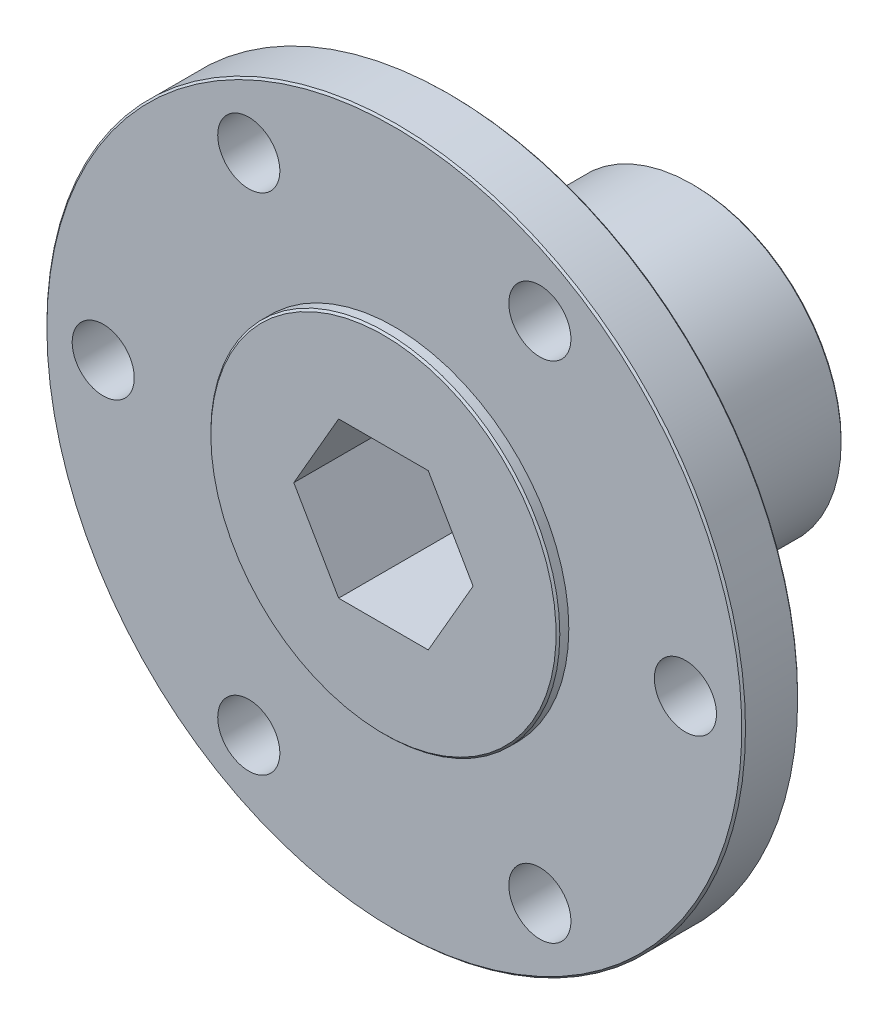
ISO-10303-21;
HEADER;
FILE_DESCRIPTION(('STEP AP214'),'2;1');
FILE_NAME('part.step','',(''),(''),'','','');
FILE_SCHEMA(('AUTOMOTIVE_DESIGN { 1 0 10303 214 1 1 1 1 }'));
ENDSEC;
DATA;
#1=APPLICATION_CONTEXT('core data for automotive mechanical design processes');
#2=APPLICATION_PROTOCOL_DEFINITION('international standard','automotive_design',2000,#1);
#3=PRODUCT_CONTEXT('',#1,'mechanical');
#4=PRODUCT('Part','Part','',(#3));
#5=PRODUCT_RELATED_PRODUCT_CATEGORY('part','',(#4));
#6=PRODUCT_DEFINITION_FORMATION('','',#4);
#7=PRODUCT_DEFINITION_CONTEXT('part definition',#1,'design');
#8=PRODUCT_DEFINITION('design','',#6,#7);
#9=PRODUCT_DEFINITION_SHAPE('','',#8);
#10=(LENGTH_UNIT() NAMED_UNIT(*) SI_UNIT(.MILLI.,.METRE.));
#11=(NAMED_UNIT(*) PLANE_ANGLE_UNIT() SI_UNIT($,.RADIAN.));
#12=(NAMED_UNIT(*) SI_UNIT($,.STERADIAN.) SOLID_ANGLE_UNIT());
#13=UNCERTAINTY_MEASURE_WITH_UNIT(LENGTH_MEASURE(1.E-05),#10,'distance_accuracy_value','');
#14=(GEOMETRIC_REPRESENTATION_CONTEXT(3) GLOBAL_UNCERTAINTY_ASSIGNED_CONTEXT((#13)) GLOBAL_UNIT_ASSIGNED_CONTEXT((#10,
#11,#12)) REPRESENTATION_CONTEXT('',''));
#15=CARTESIAN_POINT('',(0.,0.,0.));
#16=DIRECTION('',(0.,0.,1.));
#17=DIRECTION('',(1.,0.,0.));
#18=AXIS2_PLACEMENT_3D('',#15,#16,#17);
#19=CARTESIAN_POINT('',(-39.6748,0.,5.461));
#20=DIRECTION('',(0.,0.,1.));
#21=DIRECTION('',(1.,0.,0.));
#22=AXIS2_PLACEMENT_3D('',#19,#20,#21);
#23=PLANE('',#22);
#24=CARTESIAN_POINT('',(0.,0.,5.461));
#25=DIRECTION('',(0.,0.,1.));
#26=DIRECTION('',(-1.,0.,0.));
#27=AXIS2_PLACEMENT_3D('',#24,#25,#26);
#28=CIRCLE('',#27,28.4226);
#29=CARTESIAN_POINT('',(-28.4226,0.,5.461));
#30=VERTEX_POINT('',#29);
#31=EDGE_CURVE('E11',#30,#30,#28,.T.);
#32=ORIENTED_EDGE('',*,*,#31,.T.);
#33=EDGE_LOOP('',(#32));
#34=FACE_BOUND('',#33,.T.);
#35=CARTESIAN_POINT('',(-11.90625,20.6222299276169,5.461));
#36=DIRECTION('',(0.,0.,-1.));
#37=DIRECTION('',(-1.,0.,0.));
#38=AXIS2_PLACEMENT_3D('',#35,#36,#37);
#39=CIRCLE('',#38,2.53999999999993);
#40=CARTESIAN_POINT('',(-14.4462499999999,20.6222299276169,5.461));
#41=VERTEX_POINT('',#40);
#42=EDGE_CURVE('E53',#41,#41,#39,.T.);
#43=ORIENTED_EDGE('',*,*,#42,.T.);
#44=EDGE_LOOP('',(#43));
#45=FACE_BOUND('',#44,.T.);
#46=CARTESIAN_POINT('',(-23.8125,0.,5.461));
#47=DIRECTION('',(0.,0.,-1.));
#48=DIRECTION('',(-1.,0.,0.));
#49=AXIS2_PLACEMENT_3D('',#46,#47,#48);
#50=CIRCLE('',#49,2.54);
#51=CARTESIAN_POINT('',(-26.3525,0.,5.461));
#52=VERTEX_POINT('',#51);
#53=EDGE_CURVE('E299',#52,#52,#50,.T.);
#54=ORIENTED_EDGE('',*,*,#53,.T.);
#55=EDGE_LOOP('',(#54));
#56=FACE_BOUND('',#55,.T.);
#57=CARTESIAN_POINT('',(-11.90625,-20.6222299276169,5.461));
#58=DIRECTION('',(0.,0.,-1.));
#59=DIRECTION('',(-1.,0.,0.));
#60=AXIS2_PLACEMENT_3D('',#57,#58,#59);
#61=CIRCLE('',#60,2.53999999999996);
#62=CARTESIAN_POINT('',(-14.44625,-20.6222299276169,5.461));
#63=VERTEX_POINT('',#62);
#64=EDGE_CURVE('E303',#63,#63,#61,.T.);
#65=ORIENTED_EDGE('',*,*,#64,.T.);
#66=EDGE_LOOP('',(#65));
#67=FACE_BOUND('',#66,.T.);
#68=CARTESIAN_POINT('',(11.90625,-20.6222299276169,5.461));
#69=DIRECTION('',(0.,0.,-1.));
#70=DIRECTION('',(-1.,0.,0.));
#71=AXIS2_PLACEMENT_3D('',#68,#69,#70);
#72=CIRCLE('',#71,2.54);
#73=CARTESIAN_POINT('',(9.36625,-20.6222299276169,5.461));
#74=VERTEX_POINT('',#73);
#75=EDGE_CURVE('E317',#74,#74,#72,.T.);
#76=ORIENTED_EDGE('',*,*,#75,.T.);
#77=EDGE_LOOP('',(#76));
#78=FACE_BOUND('',#77,.T.);
#79=CARTESIAN_POINT('',(23.8125,0.,5.461));
#80=DIRECTION('',(0.,0.,-1.));
#81=DIRECTION('',(-1.,0.,0.));
#82=AXIS2_PLACEMENT_3D('',#79,#80,#81);
#83=CIRCLE('',#82,2.54);
#84=CARTESIAN_POINT('',(21.2725,0.,5.461));
#85=VERTEX_POINT('',#84);
#86=EDGE_CURVE('E268',#85,#85,#83,.T.);
#87=ORIENTED_EDGE('',*,*,#86,.T.);
#88=EDGE_LOOP('',(#87));
#89=FACE_BOUND('',#88,.T.);
#90=CARTESIAN_POINT('',(11.90625,20.6222299276169,5.461));
#91=DIRECTION('',(0.,0.,-1.));
#92=DIRECTION('',(-1.,0.,0.));
#93=AXIS2_PLACEMENT_3D('',#90,#91,#92);
#94=CIRCLE('',#93,2.54000000000004);
#95=CARTESIAN_POINT('',(9.36625,20.6222299276169,5.461));
#96=VERTEX_POINT('',#95);
#97=EDGE_CURVE('E264',#96,#96,#94,.T.);
#98=ORIENTED_EDGE('',*,*,#97,.T.);
#99=EDGE_LOOP('',(#98));
#100=FACE_BOUND('',#99,.T.);
#101=CARTESIAN_POINT('',(0.,0.,5.461));
#102=DIRECTION('',(0.,0.,-1.));
#103=DIRECTION('',(1.,0.,0.));
#104=AXIS2_PLACEMENT_3D('',#101,#102,#103);
#105=CIRCLE('',#104,14.2748);
#106=CARTESIAN_POINT('',(14.2748,0.,5.461));
#107=VERTEX_POINT('',#106);
#108=EDGE_CURVE('E269',#107,#107,#105,.T.);
#109=ORIENTED_EDGE('',*,*,#108,.T.);
#110=EDGE_LOOP('',(#109));
#111=FACE_BOUND('',#110,.T.);
#112=ADVANCED_FACE('F43',(#34,#45,#56,#67,#78,#89,#100,#111),#23,.T.);
#113=CARTESIAN_POINT('',(-11.90625,20.6222299276169,6.35));
#114=DIRECTION('',(0.,0.,-1.));
#115=DIRECTION('',(-1.,0.,0.));
#116=AXIS2_PLACEMENT_3D('',#113,#114,#115);
#117=CYLINDRICAL_SURFACE('',#116,2.53999999999993);
#118=CARTESIAN_POINT('',(-11.90625,20.6222299276169,0.889));
#119=DIRECTION('',(0.,0.,1.));
#120=DIRECTION('',(-1.,0.,0.));
#121=AXIS2_PLACEMENT_3D('',#118,#119,#120);
#122=CIRCLE('',#121,2.53999999999993);
#123=CARTESIAN_POINT('',(-14.4462499999999,20.6222299276169,0.889));
#124=VERTEX_POINT('',#123);
#125=EDGE_CURVE('E284',#124,#124,#122,.T.);
#126=ORIENTED_EDGE('',*,*,#125,.F.);
#127=EDGE_LOOP('',(#126));
#128=FACE_BOUND('',#127,.T.);
#129=ORIENTED_EDGE('',*,*,#42,.F.);
#130=EDGE_LOOP('',(#129));
#131=FACE_BOUND('',#130,.T.);
#132=ADVANCED_FACE('F373',(#128,#131),#117,.F.);
#133=CARTESIAN_POINT('',(-23.8125,0.,6.35));
#134=DIRECTION('',(0.,0.,-1.));
#135=DIRECTION('',(-1.,0.,0.));
#136=AXIS2_PLACEMENT_3D('',#133,#134,#135);
#137=CYLINDRICAL_SURFACE('',#136,2.54);
#138=CARTESIAN_POINT('',(-23.8125,0.,0.889));
#139=DIRECTION('',(0.,0.,1.));
#140=DIRECTION('',(-1.,0.,0.));
#141=AXIS2_PLACEMENT_3D('',#138,#139,#140);
#142=CIRCLE('',#141,2.54);
#143=CARTESIAN_POINT('',(-26.3525,0.,0.889));
#144=VERTEX_POINT('',#143);
#145=EDGE_CURVE('E298',#144,#144,#142,.T.);
#146=ORIENTED_EDGE('',*,*,#145,.F.);
#147=EDGE_LOOP('',(#146));
#148=FACE_BOUND('',#147,.T.);
#149=ORIENTED_EDGE('',*,*,#53,.F.);
#150=EDGE_LOOP('',(#149));
#151=FACE_BOUND('',#150,.T.);
#152=ADVANCED_FACE('F363',(#148,#151),#137,.F.);
#153=CARTESIAN_POINT('',(-11.90625,-20.6222299276169,6.35));
#154=DIRECTION('',(0.,0.,-1.));
#155=DIRECTION('',(-1.,0.,0.));
#156=AXIS2_PLACEMENT_3D('',#153,#154,#155);
#157=CYLINDRICAL_SURFACE('',#156,2.53999999999996);
#158=CARTESIAN_POINT('',(-11.90625,-20.6222299276169,0.889));
#159=DIRECTION('',(0.,0.,1.));
#160=DIRECTION('',(-1.,0.,0.));
#161=AXIS2_PLACEMENT_3D('',#158,#159,#160);
#162=CIRCLE('',#161,2.53999999999996);
#163=CARTESIAN_POINT('',(-14.44625,-20.6222299276169,0.889));
#164=VERTEX_POINT('',#163);
#165=EDGE_CURVE('E313',#164,#164,#162,.T.);
#166=ORIENTED_EDGE('',*,*,#165,.F.);
#167=EDGE_LOOP('',(#166));
#168=FACE_BOUND('',#167,.T.);
#169=ORIENTED_EDGE('',*,*,#64,.F.);
#170=EDGE_LOOP('',(#169));
#171=FACE_BOUND('',#170,.T.);
#172=ADVANCED_FACE('F360',(#168,#171),#157,.F.);
#173=CARTESIAN_POINT('',(11.90625,-20.6222299276169,6.35));
#174=DIRECTION('',(0.,0.,-1.));
#175=DIRECTION('',(-1.,0.,0.));
#176=AXIS2_PLACEMENT_3D('',#173,#174,#175);
#177=CYLINDRICAL_SURFACE('',#176,2.54);
#178=CARTESIAN_POINT('',(11.90625,-20.6222299276169,0.889));
#179=DIRECTION('',(0.,0.,1.));
#180=DIRECTION('',(-1.,0.,0.));
#181=AXIS2_PLACEMENT_3D('',#178,#179,#180);
#182=CIRCLE('',#181,2.54);
#183=CARTESIAN_POINT('',(9.36625,-20.6222299276169,0.889));
#184=VERTEX_POINT('',#183);
#185=EDGE_CURVE('E274',#184,#184,#182,.T.);
#186=ORIENTED_EDGE('',*,*,#185,.F.);
#187=EDGE_LOOP('',(#186));
#188=FACE_BOUND('',#187,.T.);
#189=ORIENTED_EDGE('',*,*,#75,.F.);
#190=EDGE_LOOP('',(#189));
#191=FACE_BOUND('',#190,.T.);
#192=ADVANCED_FACE('F362',(#188,#191),#177,.F.);
#193=CARTESIAN_POINT('',(23.8125,0.,6.35));
#194=DIRECTION('',(0.,0.,-1.));
#195=DIRECTION('',(-1.,0.,0.));
#196=AXIS2_PLACEMENT_3D('',#193,#194,#195);
#197=CYLINDRICAL_SURFACE('',#196,2.54);
#198=CARTESIAN_POINT('',(23.8125,0.,0.889));
#199=DIRECTION('',(0.,0.,1.));
#200=DIRECTION('',(-1.,0.,0.));
#201=AXIS2_PLACEMENT_3D('',#198,#199,#200);
#202=CIRCLE('',#201,2.54);
#203=CARTESIAN_POINT('',(21.2725,0.,0.889));
#204=VERTEX_POINT('',#203);
#205=EDGE_CURVE('E270',#204,#204,#202,.T.);
#206=ORIENTED_EDGE('',*,*,#205,.F.);
#207=EDGE_LOOP('',(#206));
#208=FACE_BOUND('',#207,.T.);
#209=ORIENTED_EDGE('',*,*,#86,.F.);
#210=EDGE_LOOP('',(#209));
#211=FACE_BOUND('',#210,.T.);
#212=ADVANCED_FACE('F370',(#208,#211),#197,.F.);
#213=CARTESIAN_POINT('',(11.90625,20.6222299276169,6.35));
#214=DIRECTION('',(0.,0.,-1.));
#215=DIRECTION('',(-1.,0.,0.));
#216=AXIS2_PLACEMENT_3D('',#213,#214,#215);
#217=CYLINDRICAL_SURFACE('',#216,2.54000000000004);
#218=CARTESIAN_POINT('',(11.90625,20.6222299276169,0.889));
#219=DIRECTION('',(0.,0.,1.));
#220=DIRECTION('',(-1.,0.,0.));
#221=AXIS2_PLACEMENT_3D('',#218,#219,#220);
#222=CIRCLE('',#221,2.54000000000004);
#223=CARTESIAN_POINT('',(9.36625,20.6222299276169,0.889));
#224=VERTEX_POINT('',#223);
#225=EDGE_CURVE('E47',#224,#224,#222,.T.);
#226=ORIENTED_EDGE('',*,*,#225,.F.);
#227=EDGE_LOOP('',(#226));
#228=FACE_BOUND('',#227,.T.);
#229=ORIENTED_EDGE('',*,*,#97,.F.);
#230=EDGE_LOOP('',(#229));
#231=FACE_BOUND('',#230,.T.);
#232=ADVANCED_FACE('F401',(#228,#231),#217,.F.);
#233=CARTESIAN_POINT('',(0.,0.,0.));
#234=DIRECTION('',(0.,0.,1.));
#235=DIRECTION('',(1.,0.,0.));
#236=AXIS2_PLACEMENT_3D('',#233,#234,#235);
#237=CYLINDRICAL_SURFACE('',#236,14.2748);
#238=CARTESIAN_POINT('',(0.,0.,6.1976));
#239=DIRECTION('',(0.,0.,-1.));
#240=DIRECTION('',(1.,0.,0.));
#241=AXIS2_PLACEMENT_3D('',#238,#239,#240);
#242=CIRCLE('',#241,14.2748);
#243=CARTESIAN_POINT('',(14.2748,0.,6.1976));
#244=VERTEX_POINT('',#243);
#245=EDGE_CURVE('E293',#244,#244,#242,.T.);
#246=ORIENTED_EDGE('',*,*,#245,.T.);
#247=EDGE_LOOP('',(#246));
#248=FACE_BOUND('',#247,.T.);
#249=ORIENTED_EDGE('',*,*,#108,.F.);
#250=EDGE_LOOP('',(#249));
#251=FACE_BOUND('',#250,.T.);
#252=ADVANCED_FACE('F393',(#248,#251),#237,.T.);
#253=CARTESIAN_POINT('',(0.,0.,5.3086));
#254=DIRECTION('',(0.,0.,-1.));
#255=DIRECTION('',(-1.,0.,0.));
#256=AXIS2_PLACEMENT_3D('',#253,#254,#255);
#257=CONICAL_SURFACE('',#256,28.575,0.785398163397451);
#258=CARTESIAN_POINT('',(0.,0.,5.3086));
#259=DIRECTION('',(0.,0.,1.));
#260=DIRECTION('',(-1.,0.,0.));
#261=AXIS2_PLACEMENT_3D('',#258,#259,#260);
#262=CIRCLE('',#261,28.575);
#263=CARTESIAN_POINT('',(-28.575,0.,5.3086));
#264=VERTEX_POINT('',#263);
#265=EDGE_CURVE('E283',#264,#264,#262,.T.);
#266=ORIENTED_EDGE('',*,*,#265,.T.);
#267=EDGE_LOOP('',(#266));
#268=FACE_BOUND('',#267,.T.);
#269=ORIENTED_EDGE('',*,*,#31,.F.);
#270=EDGE_LOOP('',(#269));
#271=FACE_BOUND('',#270,.T.);
#272=ADVANCED_FACE('F390',(#268,#271),#257,.T.);
#273=CARTESIAN_POINT('',(-39.6748,0.,0.889));
#274=DIRECTION('',(0.,0.,-1.));
#275=DIRECTION('',(0.,-1.,0.));
#276=AXIS2_PLACEMENT_3D('',#273,#274,#275);
#277=PLANE('',#276);
#278=CARTESIAN_POINT('',(0.,0.,0.889));
#279=DIRECTION('',(0.,0.,-1.));
#280=DIRECTION('',(1.,0.,0.));
#281=AXIS2_PLACEMENT_3D('',#278,#279,#280);
#282=CIRCLE('',#281,28.4226);
#283=CARTESIAN_POINT('',(28.4226,0.,0.889));
#284=VERTEX_POINT('',#283);
#285=EDGE_CURVE('E279',#284,#284,#282,.T.);
#286=ORIENTED_EDGE('',*,*,#285,.T.);
#287=EDGE_LOOP('',(#286));
#288=FACE_BOUND('',#287,.T.);
#289=ORIENTED_EDGE('',*,*,#125,.T.);
#290=EDGE_LOOP('',(#289));
#291=FACE_BOUND('',#290,.T.);
#292=ORIENTED_EDGE('',*,*,#145,.T.);
#293=EDGE_LOOP('',(#292));
#294=FACE_BOUND('',#293,.T.);
#295=ORIENTED_EDGE('',*,*,#165,.T.);
#296=EDGE_LOOP('',(#295));
#297=FACE_BOUND('',#296,.T.);
#298=ORIENTED_EDGE('',*,*,#185,.T.);
#299=EDGE_LOOP('',(#298));
#300=FACE_BOUND('',#299,.T.);
#301=ORIENTED_EDGE('',*,*,#205,.T.);
#302=EDGE_LOOP('',(#301));
#303=FACE_BOUND('',#302,.T.);
#304=ORIENTED_EDGE('',*,*,#225,.T.);
#305=EDGE_LOOP('',(#304));
#306=FACE_BOUND('',#305,.T.);
#307=CARTESIAN_POINT('',(0.,0.,0.889));
#308=DIRECTION('',(0.,0.,1.));
#309=DIRECTION('',(1.,0.,0.));
#310=AXIS2_PLACEMENT_3D('',#307,#308,#309);
#311=CIRCLE('',#310,14.2748);
#312=CARTESIAN_POINT('',(14.2748,0.,0.889));
#313=VERTEX_POINT('',#312);
#314=EDGE_CURVE('E289',#313,#313,#311,.T.);
#315=ORIENTED_EDGE('',*,*,#314,.T.);
#316=EDGE_LOOP('',(#315));
#317=FACE_BOUND('',#316,.T.);
#318=ADVANCED_FACE('F392',(#288,#291,#294,#297,#300,#303,#306,#317),#277,.T.);
#319=CARTESIAN_POINT('',(0.,0.,6.1976));
#320=DIRECTION('',(0.,0.,-1.));
#321=DIRECTION('',(-1.,0.,0.));
#322=AXIS2_PLACEMENT_3D('',#319,#320,#321);
#323=CONICAL_SURFACE('',#322,14.2748,0.785398163397477);
#324=ORIENTED_EDGE('',*,*,#245,.F.);
#325=EDGE_LOOP('',(#324));
#326=FACE_BOUND('',#325,.T.);
#327=CARTESIAN_POINT('',(0.,0.,6.35));
#328=DIRECTION('',(0.,0.,-1.));
#329=DIRECTION('',(-1.,0.,0.));
#330=AXIS2_PLACEMENT_3D('',#327,#328,#329);
#331=CIRCLE('',#330,14.1224);
#332=CARTESIAN_POINT('',(-14.1224,0.,6.35));
#333=VERTEX_POINT('',#332);
#334=EDGE_CURVE('E285',#333,#333,#331,.T.);
#335=ORIENTED_EDGE('',*,*,#334,.T.);
#336=EDGE_LOOP('',(#335));
#337=FACE_BOUND('',#336,.T.);
#338=ADVANCED_FACE('F388',(#326,#337),#323,.T.);
#339=CARTESIAN_POINT('',(0.,0.,6.35));
#340=DIRECTION('',(0.,0.,-1.));
#341=DIRECTION('',(-1.,0.,0.));
#342=AXIS2_PLACEMENT_3D('',#339,#340,#341);
#343=CYLINDRICAL_SURFACE('',#342,28.575);
#344=ORIENTED_EDGE('',*,*,#265,.F.);
#345=EDGE_LOOP('',(#344));
#346=FACE_BOUND('',#345,.T.);
#347=CARTESIAN_POINT('',(0.,0.,1.04140000000001));
#348=DIRECTION('',(0.,0.,1.));
#349=DIRECTION('',(-1.,0.,0.));
#350=AXIS2_PLACEMENT_3D('',#347,#348,#349);
#351=CIRCLE('',#350,28.575);
#352=CARTESIAN_POINT('',(-28.575,0.,1.04140000000001));
#353=VERTEX_POINT('',#352);
#354=EDGE_CURVE('E290',#353,#353,#351,.T.);
#355=ORIENTED_EDGE('',*,*,#354,.T.);
#356=EDGE_LOOP('',(#355));
#357=FACE_BOUND('',#356,.T.);
#358=ADVANCED_FACE('F406',(#346,#357),#343,.T.);
#359=CARTESIAN_POINT('',(0.,0.,0.));
#360=DIRECTION('',(0.,0.,1.));
#361=DIRECTION('',(1.,0.,0.));
#362=AXIS2_PLACEMENT_3D('',#359,#360,#361);
#363=CYLINDRICAL_SURFACE('',#362,14.2748);
#364=ORIENTED_EDGE('',*,*,#314,.F.);
#365=EDGE_LOOP('',(#364));
#366=FACE_BOUND('',#365,.T.);
#367=CARTESIAN_POINT('',(0.,0.,0.1524));
#368=DIRECTION('',(0.,0.,1.));
#369=DIRECTION('',(1.,0.,0.));
#370=AXIS2_PLACEMENT_3D('',#367,#368,#369);
#371=CIRCLE('',#370,14.2748);
#372=CARTESIAN_POINT('',(14.2748,0.,0.1524));
#373=VERTEX_POINT('',#372);
#374=EDGE_CURVE('E308',#373,#373,#371,.T.);
#375=ORIENTED_EDGE('',*,*,#374,.T.);
#376=EDGE_LOOP('',(#375));
#377=FACE_BOUND('',#376,.T.);
#378=ADVANCED_FACE('F409',(#366,#377),#363,.T.);
#379=CARTESIAN_POINT('',(0.,0.,1.04140000000001));
#380=DIRECTION('',(0.,0.,1.));
#381=DIRECTION('',(1.,0.,0.));
#382=AXIS2_PLACEMENT_3D('',#379,#380,#381);
#383=CONICAL_SURFACE('',#382,28.575,0.785398163397446);
#384=ORIENTED_EDGE('',*,*,#354,.F.);
#385=EDGE_LOOP('',(#384));
#386=FACE_BOUND('',#385,.T.);
#387=ORIENTED_EDGE('',*,*,#285,.F.);
#388=EDGE_LOOP('',(#387));
#389=FACE_BOUND('',#388,.T.);
#390=ADVANCED_FACE('F412',(#386,#389),#383,.T.);
#391=CARTESIAN_POINT('',(0.,0.,6.35));
#392=DIRECTION('',(0.,0.,1.));
#393=DIRECTION('',(1.,0.,0.));
#394=AXIS2_PLACEMENT_3D('',#391,#392,#393);
#395=PLANE('',#394);
#396=DIRECTION('',(-1.,0.,0.));
#397=VECTOR('',#396,1.);
#398=CARTESIAN_POINT('',(0.,-6.35,6.35));
#399=LINE('',#398,#397);
#400=CARTESIAN_POINT('',(3.66617420935413,-6.35,6.35));
#401=VERTEX_POINT('',#400);
#402=CARTESIAN_POINT('',(-3.66617420935412,-6.35,6.35));
#403=VERTEX_POINT('',#402);
#404=EDGE_CURVE('E218',#401,#403,#399,.T.);
#405=ORIENTED_EDGE('',*,*,#404,.T.);
#406=DIRECTION('',(-0.5,0.866025403784439,0.));
#407=VECTOR('',#406,1.);
#408=CARTESIAN_POINT('',(-5.49926131403119,-3.175,6.35));
#409=LINE('',#408,#407);
#410=CARTESIAN_POINT('',(-7.33234841870825,0.,6.35));
#411=VERTEX_POINT('',#410);
#412=EDGE_CURVE('E204',#403,#411,#409,.T.);
#413=ORIENTED_EDGE('',*,*,#412,.T.);
#414=DIRECTION('',(0.5,0.866025403784439,0.));
#415=VECTOR('',#414,1.);
#416=CARTESIAN_POINT('',(-5.49926131403118,3.175,6.35));
#417=LINE('',#416,#415);
#418=CARTESIAN_POINT('',(-3.66617420935412,6.35,6.35));
#419=VERTEX_POINT('',#418);
#420=EDGE_CURVE('E250',#411,#419,#417,.T.);
#421=ORIENTED_EDGE('',*,*,#420,.T.);
#422=DIRECTION('',(1.,0.,0.));
#423=VECTOR('',#422,1.);
#424=CARTESIAN_POINT('',(0.,6.35,6.35));
#425=LINE('',#424,#423);
#426=CARTESIAN_POINT('',(3.66617420935412,6.35,6.35));
#427=VERTEX_POINT('',#426);
#428=EDGE_CURVE('E245',#419,#427,#425,.T.);
#429=ORIENTED_EDGE('',*,*,#428,.T.);
#430=DIRECTION('',(0.5,-0.866025403784439,0.));
#431=VECTOR('',#430,1.);
#432=CARTESIAN_POINT('',(5.49926131403119,3.175,6.35));
#433=LINE('',#432,#431);
#434=CARTESIAN_POINT('',(7.33234841870825,0.,6.35));
#435=VERTEX_POINT('',#434);
#436=EDGE_CURVE('E241',#427,#435,#433,.T.);
#437=ORIENTED_EDGE('',*,*,#436,.T.);
#438=DIRECTION('',(-0.5,-0.866025403784439,0.));
#439=VECTOR('',#438,1.);
#440=CARTESIAN_POINT('',(5.49926131403119,-3.175,6.35));
#441=LINE('',#440,#439);
#442=EDGE_CURVE('E228',#435,#401,#441,.T.);
#443=ORIENTED_EDGE('',*,*,#442,.T.);
#444=EDGE_LOOP('',(#405,#413,#421,#429,#437,#443));
#445=FACE_BOUND('',#444,.T.);
#446=ORIENTED_EDGE('',*,*,#334,.F.);
#447=EDGE_LOOP('',(#446));
#448=FACE_BOUND('',#447,.T.);
#449=ADVANCED_FACE('F225',(#445,#448),#395,.T.);
#450=CARTESIAN_POINT('',(0.,0.,0.1524));
#451=DIRECTION('',(0.,0.,1.));
#452=DIRECTION('',(1.,0.,0.));
#453=AXIS2_PLACEMENT_3D('',#450,#451,#452);
#454=CONICAL_SURFACE('',#453,14.2748,0.785398163397461);
#455=ORIENTED_EDGE('',*,*,#374,.F.);
#456=EDGE_LOOP('',(#455));
#457=FACE_BOUND('',#456,.T.);
#458=CARTESIAN_POINT('',(0.,0.,0.));
#459=DIRECTION('',(0.,0.,1.));
#460=DIRECTION('',(1.,0.,0.));
#461=AXIS2_PLACEMENT_3D('',#458,#459,#460);
#462=CIRCLE('',#461,14.1224);
#463=CARTESIAN_POINT('',(14.1224,0.,0.));
#464=VERTEX_POINT('',#463);
#465=EDGE_CURVE('E304',#464,#464,#462,.T.);
#466=ORIENTED_EDGE('',*,*,#465,.T.);
#467=EDGE_LOOP('',(#466));
#468=FACE_BOUND('',#467,.T.);
#469=ADVANCED_FACE('F428',(#457,#468),#454,.T.);
#470=CARTESIAN_POINT('',(0.,0.,0.));
#471=DIRECTION('',(0.,0.,1.));
#472=DIRECTION('',(1.,0.,0.));
#473=AXIS2_PLACEMENT_3D('',#470,#471,#472);
#474=PLANE('',#473);
#475=ORIENTED_EDGE('',*,*,#465,.F.);
#476=EDGE_LOOP('',(#475));
#477=FACE_BOUND('',#476,.T.);
#478=CARTESIAN_POINT('',(0.,0.,0.));
#479=DIRECTION('',(0.,0.,-1.));
#480=DIRECTION('',(1.,0.,0.));
#481=AXIS2_PLACEMENT_3D('',#478,#479,#480);
#482=CIRCLE('',#481,12.7);
#483=CARTESIAN_POINT('',(12.7,0.,0.));
#484=VERTEX_POINT('',#483);
#485=EDGE_CURVE('E336',#484,#484,#482,.T.);
#486=ORIENTED_EDGE('',*,*,#485,.F.);
#487=EDGE_LOOP('',(#486));
#488=FACE_BOUND('',#487,.T.);
#489=ADVANCED_FACE('F431',(#477,#488),#474,.F.);
#490=CARTESIAN_POINT('',(0.,0.,-19.05));
#491=DIRECTION('',(0.,0.,-1.));
#492=DIRECTION('',(0.,-1.,0.));
#493=AXIS2_PLACEMENT_3D('',#490,#491,#492);
#494=PLANE('',#493);
#495=DIRECTION('',(-1.,0.,0.));
#496=VECTOR('',#495,1.);
#497=CARTESIAN_POINT('',(0.,-6.35,-19.05));
#498=LINE('',#497,#496);
#499=CARTESIAN_POINT('',(3.66617420935412,-6.35,-19.05));
#500=VERTEX_POINT('',#499);
#501=CARTESIAN_POINT('',(-3.66617420935412,-6.35,-19.05));
#502=VERTEX_POINT('',#501);
#503=EDGE_CURVE('E221',#500,#502,#498,.T.);
#504=ORIENTED_EDGE('',*,*,#503,.F.);
#505=DIRECTION('',(-0.5,-0.866025403784439,0.));
#506=VECTOR('',#505,1.);
#507=CARTESIAN_POINT('',(5.49926131403119,-3.175,-19.05));
#508=LINE('',#507,#506);
#509=CARTESIAN_POINT('',(7.33234841870825,0.,-19.05));
#510=VERTEX_POINT('',#509);
#511=EDGE_CURVE('E236',#510,#500,#508,.T.);
#512=ORIENTED_EDGE('',*,*,#511,.F.);
#513=DIRECTION('',(0.5,-0.866025403784439,0.));
#514=VECTOR('',#513,1.);
#515=CARTESIAN_POINT('',(5.49926131403119,3.175,-19.05));
#516=LINE('',#515,#514);
#517=CARTESIAN_POINT('',(3.66617420935412,6.35,-19.05));
#518=VERTEX_POINT('',#517);
#519=EDGE_CURVE('E69',#518,#510,#516,.T.);
#520=ORIENTED_EDGE('',*,*,#519,.F.);
#521=DIRECTION('',(1.,0.,0.));
#522=VECTOR('',#521,1.);
#523=CARTESIAN_POINT('',(0.,6.35,-19.05));
#524=LINE('',#523,#522);
#525=CARTESIAN_POINT('',(-3.66617420935412,6.35,-19.05));
#526=VERTEX_POINT('',#525);
#527=EDGE_CURVE('E232',#526,#518,#524,.T.);
#528=ORIENTED_EDGE('',*,*,#527,.F.);
#529=DIRECTION('',(0.5,0.866025403784439,0.));
#530=VECTOR('',#529,1.);
#531=CARTESIAN_POINT('',(-5.49926131403118,3.175,-19.05));
#532=LINE('',#531,#530);
#533=CARTESIAN_POINT('',(-7.33234841870825,0.,-19.05));
#534=VERTEX_POINT('',#533);
#535=EDGE_CURVE('E466',#534,#526,#532,.T.);
#536=ORIENTED_EDGE('',*,*,#535,.F.);
#537=DIRECTION('',(-0.5,0.866025403784439,0.));
#538=VECTOR('',#537,1.);
#539=CARTESIAN_POINT('',(-5.49926131403119,-3.175,-19.05));
#540=LINE('',#539,#538);
#541=EDGE_CURVE('E462',#502,#534,#540,.T.);
#542=ORIENTED_EDGE('',*,*,#541,.F.);
#543=EDGE_LOOP('',(#504,#512,#520,#528,#536,#542));
#544=FACE_BOUND('',#543,.T.);
#545=CARTESIAN_POINT('',(0.,0.,-19.05));
#546=DIRECTION('',(0.,0.,-1.));
#547=DIRECTION('',(1.,0.,0.));
#548=AXIS2_PLACEMENT_3D('',#545,#546,#547);
#549=CIRCLE('',#548,12.0396);
#550=CARTESIAN_POINT('',(12.0396,0.,-19.05));
#551=VERTEX_POINT('',#550);
#552=EDGE_CURVE('E309',#551,#551,#549,.T.);
#553=ORIENTED_EDGE('',*,*,#552,.T.);
#554=EDGE_LOOP('',(#553));
#555=FACE_BOUND('',#554,.T.);
#556=ADVANCED_FACE('F436',(#544,#555),#494,.T.);
#557=CARTESIAN_POINT('',(0.,0.,0.));
#558=DIRECTION('',(0.,0.,1.));
#559=DIRECTION('',(1.,0.,0.));
#560=AXIS2_PLACEMENT_3D('',#557,#558,#559);
#561=CONICAL_SURFACE('',#560,12.7,0.785398163397448);
#562=ORIENTED_EDGE('',*,*,#485,.T.);
#563=EDGE_LOOP('',(#562));
#564=FACE_BOUND('',#563,.T.);
#565=CARTESIAN_POINT('',(0.,0.,-0.50800000000005));
#566=DIRECTION('',(0.,0.,1.));
#567=DIRECTION('',(1.,0.,0.));
#568=AXIS2_PLACEMENT_3D('',#565,#566,#567);
#569=CIRCLE('',#568,12.192);
#570=CARTESIAN_POINT('',(12.192,0.,-0.50800000000005));
#571=VERTEX_POINT('',#570);
#572=EDGE_CURVE('E278',#571,#571,#569,.T.);
#573=ORIENTED_EDGE('',*,*,#572,.T.);
#574=EDGE_LOOP('',(#573));
#575=FACE_BOUND('',#574,.T.);
#576=ADVANCED_FACE('F45',(#564,#575),#561,.T.);
#577=CARTESIAN_POINT('',(0.,0.,-18.8976));
#578=DIRECTION('',(0.,0.,1.));
#579=DIRECTION('',(1.,0.,0.));
#580=AXIS2_PLACEMENT_3D('',#577,#578,#579);
#581=CONICAL_SURFACE('',#580,12.192,0.785398163397448);
#582=CARTESIAN_POINT('',(0.,0.,-18.8976));
#583=DIRECTION('',(0.,0.,-1.));
#584=DIRECTION('',(1.,0.,0.));
#585=AXIS2_PLACEMENT_3D('',#582,#583,#584);
#586=CIRCLE('',#585,12.192);
#587=CARTESIAN_POINT('',(12.192,0.,-18.8976));
#588=VERTEX_POINT('',#587);
#589=EDGE_CURVE('E263',#588,#588,#586,.T.);
#590=ORIENTED_EDGE('',*,*,#589,.T.);
#591=EDGE_LOOP('',(#590));
#592=FACE_BOUND('',#591,.T.);
#593=ORIENTED_EDGE('',*,*,#552,.F.);
#594=EDGE_LOOP('',(#593));
#595=FACE_BOUND('',#594,.T.);
#596=ADVANCED_FACE('F441',(#592,#595),#581,.T.);
#597=CARTESIAN_POINT('',(0.,0.,-19.05));
#598=DIRECTION('',(0.,0.,1.));
#599=DIRECTION('',(1.,0.,0.));
#600=AXIS2_PLACEMENT_3D('',#597,#598,#599);
#601=CYLINDRICAL_SURFACE('',#600,12.192);
#602=ORIENTED_EDGE('',*,*,#589,.F.);
#603=EDGE_LOOP('',(#602));
#604=FACE_BOUND('',#603,.T.);
#605=ORIENTED_EDGE('',*,*,#572,.F.);
#606=EDGE_LOOP('',(#605));
#607=FACE_BOUND('',#606,.T.);
#608=ADVANCED_FACE('F443',(#604,#607),#601,.T.);
#609=CARTESIAN_POINT('',(0.,-6.35,25.7495704419797));
#610=DIRECTION('',(0.,-1.,0.));
#611=DIRECTION('',(0.,0.,-1.));
#612=AXIS2_PLACEMENT_3D('',#609,#610,#611);
#613=PLANE('',#612);
#614=DIRECTION('',(0.,0.,-1.));
#615=VECTOR('',#614,1.);
#616=CARTESIAN_POINT('',(3.66617420935412,-6.35,25.7495704419797));
#617=LINE('',#616,#615);
#618=EDGE_CURVE('E61',#401,#500,#617,.T.);
#619=ORIENTED_EDGE('',*,*,#618,.T.);
#620=ORIENTED_EDGE('',*,*,#503,.T.);
#621=DIRECTION('',(0.,0.,-1.));
#622=VECTOR('',#621,1.);
#623=CARTESIAN_POINT('',(-3.66617420935412,-6.35,25.7495704419797));
#624=LINE('',#623,#622);
#625=EDGE_CURVE('E208',#403,#502,#624,.T.);
#626=ORIENTED_EDGE('',*,*,#625,.F.);
#627=ORIENTED_EDGE('',*,*,#404,.F.);
#628=EDGE_LOOP('',(#619,#620,#626,#627));
#629=FACE_BOUND('',#628,.T.);
#630=ADVANCED_FACE('F217',(#629),#613,.F.);
#631=CARTESIAN_POINT('',(-5.49926131403119,-3.175,25.7495704419797));
#632=DIRECTION('',(-0.866025403784439,-0.5,0.));
#633=DIRECTION('',(0.5,-0.866025403784439,0.));
#634=AXIS2_PLACEMENT_3D('',#631,#632,#633);
#635=PLANE('',#634);
#636=ORIENTED_EDGE('',*,*,#625,.T.);
#637=ORIENTED_EDGE('',*,*,#541,.T.);
#638=DIRECTION('',(0.,0.,-1.));
#639=VECTOR('',#638,1.);
#640=CARTESIAN_POINT('',(-7.33234841870825,0.,25.7495704419797));
#641=LINE('',#640,#639);
#642=EDGE_CURVE('E210',#411,#534,#641,.T.);
#643=ORIENTED_EDGE('',*,*,#642,.F.);
#644=ORIENTED_EDGE('',*,*,#412,.F.);
#645=EDGE_LOOP('',(#636,#637,#643,#644));
#646=FACE_BOUND('',#645,.T.);
#647=ADVANCED_FACE('F206',(#646),#635,.F.);
#648=CARTESIAN_POINT('',(-5.49926131403118,3.175,25.7495704419797));
#649=DIRECTION('',(-0.866025403784439,0.5,0.));
#650=DIRECTION('',(-0.5,-0.866025403784439,0.));
#651=AXIS2_PLACEMENT_3D('',#648,#649,#650);
#652=PLANE('',#651);
#653=ORIENTED_EDGE('',*,*,#642,.T.);
#654=ORIENTED_EDGE('',*,*,#535,.T.);
#655=DIRECTION('',(0.,0.,-1.));
#656=VECTOR('',#655,1.);
#657=CARTESIAN_POINT('',(-3.66617420935412,6.35,25.7495704419797));
#658=LINE('',#657,#656);
#659=EDGE_CURVE('E249',#419,#526,#658,.T.);
#660=ORIENTED_EDGE('',*,*,#659,.F.);
#661=ORIENTED_EDGE('',*,*,#420,.F.);
#662=EDGE_LOOP('',(#653,#654,#660,#661));
#663=FACE_BOUND('',#662,.T.);
#664=ADVANCED_FACE('F480',(#663),#652,.F.);
#665=CARTESIAN_POINT('',(0.,6.35,25.7495704419797));
#666=DIRECTION('',(0.,1.,0.));
#667=DIRECTION('',(0.,0.,1.));
#668=AXIS2_PLACEMENT_3D('',#665,#666,#667);
#669=PLANE('',#668);
#670=ORIENTED_EDGE('',*,*,#659,.T.);
#671=ORIENTED_EDGE('',*,*,#527,.T.);
#672=DIRECTION('',(0.,0.,-1.));
#673=VECTOR('',#672,1.);
#674=CARTESIAN_POINT('',(3.66617420935412,6.35,25.7495704419797));
#675=LINE('',#674,#673);
#676=EDGE_CURVE('E244',#427,#518,#675,.T.);
#677=ORIENTED_EDGE('',*,*,#676,.F.);
#678=ORIENTED_EDGE('',*,*,#428,.F.);
#679=EDGE_LOOP('',(#670,#671,#677,#678));
#680=FACE_BOUND('',#679,.T.);
#681=ADVANCED_FACE('F477',(#680),#669,.F.);
#682=CARTESIAN_POINT('',(5.49926131403119,3.175,25.7495704419797));
#683=DIRECTION('',(0.866025403784438,0.5,0.));
#684=DIRECTION('',(-0.5,0.866025403784439,0.));
#685=AXIS2_PLACEMENT_3D('',#682,#683,#684);
#686=PLANE('',#685);
#687=ORIENTED_EDGE('',*,*,#676,.T.);
#688=ORIENTED_EDGE('',*,*,#519,.T.);
#689=DIRECTION('',(0.,0.,-1.));
#690=VECTOR('',#689,1.);
#691=CARTESIAN_POINT('',(7.33234841870825,0.,25.7495704419797));
#692=LINE('',#691,#690);
#693=EDGE_CURVE('E240',#435,#510,#692,.T.);
#694=ORIENTED_EDGE('',*,*,#693,.F.);
#695=ORIENTED_EDGE('',*,*,#436,.F.);
#696=EDGE_LOOP('',(#687,#688,#694,#695));
#697=FACE_BOUND('',#696,.T.);
#698=ADVANCED_FACE('F481',(#697),#686,.F.);
#699=CARTESIAN_POINT('',(5.49926131403119,-3.175,25.7495704419797));
#700=DIRECTION('',(0.866025403784438,-0.5,0.));
#701=DIRECTION('',(0.5,0.866025403784439,0.));
#702=AXIS2_PLACEMENT_3D('',#699,#700,#701);
#703=PLANE('',#702);
#704=ORIENTED_EDGE('',*,*,#693,.T.);
#705=ORIENTED_EDGE('',*,*,#511,.T.);
#706=ORIENTED_EDGE('',*,*,#618,.F.);
#707=ORIENTED_EDGE('',*,*,#442,.F.);
#708=EDGE_LOOP('',(#704,#705,#706,#707));
#709=FACE_BOUND('',#708,.T.);
#710=ADVANCED_FACE('F482',(#709),#703,.F.);
#711=CLOSED_SHELL('',(#112,#132,#152,#172,#192,#212,#232,#252,#272,#318,#338,#358,#378,#390,
#449,#469,#489,#556,#576,#596,#608,#630,#647,#664,#681,#698,#710));
#712=MANIFOLD_SOLID_BREP('B2',#711);
#713=ADVANCED_BREP_SHAPE_REPRESENTATION('',(#18,#712),#14);
#714=SHAPE_DEFINITION_REPRESENTATION(#9,#713);
ENDSEC;
END-ISO-10303-21;
